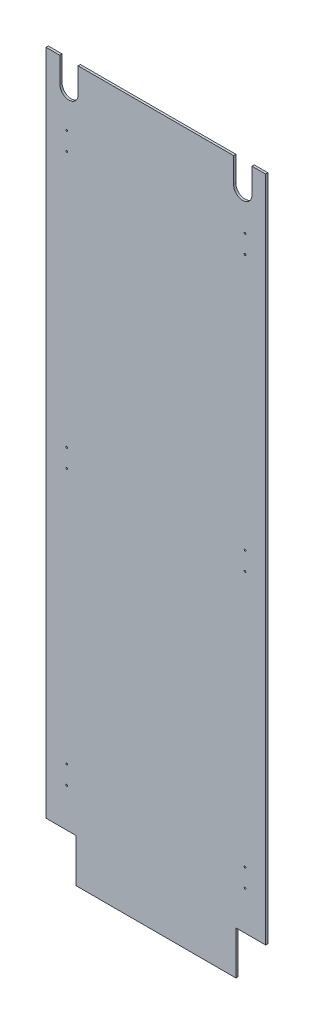
ISO-10303-21;
HEADER;
FILE_DESCRIPTION(('STEP AP214'),'2;1');
FILE_NAME('part.step','',(''),(''),'','','');
FILE_SCHEMA(('AUTOMOTIVE_DESIGN { 1 0 10303 214 1 1 1 1 }'));
ENDSEC;
DATA;
#1=APPLICATION_CONTEXT('core data for automotive mechanical design processes');
#2=APPLICATION_PROTOCOL_DEFINITION('international standard','automotive_design',2000,#1);
#3=PRODUCT_CONTEXT('',#1,'mechanical');
#4=PRODUCT('Part','Part','',(#3));
#5=PRODUCT_RELATED_PRODUCT_CATEGORY('part','',(#4));
#6=PRODUCT_DEFINITION_FORMATION('','',#4);
#7=PRODUCT_DEFINITION_CONTEXT('part definition',#1,'design');
#8=PRODUCT_DEFINITION('design','',#6,#7);
#9=PRODUCT_DEFINITION_SHAPE('','',#8);
#10=(LENGTH_UNIT() NAMED_UNIT(*) SI_UNIT(.MILLI.,.METRE.));
#11=(NAMED_UNIT(*) PLANE_ANGLE_UNIT() SI_UNIT($,.RADIAN.));
#12=(NAMED_UNIT(*) SI_UNIT($,.STERADIAN.) SOLID_ANGLE_UNIT());
#13=UNCERTAINTY_MEASURE_WITH_UNIT(LENGTH_MEASURE(1.E-05),#10,'distance_accuracy_value','');
#14=(GEOMETRIC_REPRESENTATION_CONTEXT(3) GLOBAL_UNCERTAINTY_ASSIGNED_CONTEXT((#13)) GLOBAL_UNIT_ASSIGNED_CONTEXT((#10,
#11,#12)) REPRESENTATION_CONTEXT('',''));
#15=CARTESIAN_POINT('',(0.,0.,0.));
#16=DIRECTION('',(0.,0.,1.));
#17=DIRECTION('',(1.,0.,0.));
#18=AXIS2_PLACEMENT_3D('',#15,#16,#17);
#19=CARTESIAN_POINT('',(0.,0.,6.35));
#20=DIRECTION('',(0.,0.,1.));
#21=DIRECTION('',(1.,0.,0.));
#22=AXIS2_PLACEMENT_3D('',#19,#20,#21);
#23=PLANE('',#22);
#24=CARTESIAN_POINT('',(247.65,815.975,6.35));
#25=DIRECTION('',(0.,0.,-1.));
#26=DIRECTION('',(-1.,0.,0.));
#27=AXIS2_PLACEMENT_3D('',#24,#25,#26);
#28=CIRCLE('',#27,2.3876);
#29=CARTESIAN_POINT('',(245.2624,815.975,6.35));
#30=VERTEX_POINT('',#29);
#31=EDGE_CURVE('E261',#30,#30,#28,.T.);
#32=ORIENTED_EDGE('',*,*,#31,.T.);
#33=EDGE_LOOP('',(#32));
#34=FACE_BOUND('',#33,.T.);
#35=CARTESIAN_POINT('',(247.65,765.175,6.35));
#36=DIRECTION('',(0.,0.,-1.));
#37=DIRECTION('',(-1.,0.,0.));
#38=AXIS2_PLACEMENT_3D('',#35,#36,#37);
#39=CIRCLE('',#38,2.3876);
#40=CARTESIAN_POINT('',(245.2624,765.175,6.35));
#41=VERTEX_POINT('',#40);
#42=EDGE_CURVE('E264',#41,#41,#39,.T.);
#43=ORIENTED_EDGE('',*,*,#42,.T.);
#44=EDGE_LOOP('',(#43));
#45=FACE_BOUND('',#44,.T.);
#46=CARTESIAN_POINT('',(-247.65,815.975,6.35));
#47=DIRECTION('',(0.,0.,-1.));
#48=DIRECTION('',(-1.,0.,0.));
#49=AXIS2_PLACEMENT_3D('',#46,#47,#48);
#50=CIRCLE('',#49,2.3876);
#51=CARTESIAN_POINT('',(-250.0376,815.975,6.35));
#52=VERTEX_POINT('',#51);
#53=EDGE_CURVE('E267',#52,#52,#50,.T.);
#54=ORIENTED_EDGE('',*,*,#53,.T.);
#55=EDGE_LOOP('',(#54));
#56=FACE_BOUND('',#55,.T.);
#57=CARTESIAN_POINT('',(-247.65,765.175,6.35));
#58=DIRECTION('',(0.,0.,-1.));
#59=DIRECTION('',(-1.,0.,0.));
#60=AXIS2_PLACEMENT_3D('',#57,#58,#59);
#61=CIRCLE('',#60,2.3876);
#62=CARTESIAN_POINT('',(-250.0376,765.175,6.35));
#63=VERTEX_POINT('',#62);
#64=EDGE_CURVE('E270',#63,#63,#61,.T.);
#65=ORIENTED_EDGE('',*,*,#64,.T.);
#66=EDGE_LOOP('',(#65));
#67=FACE_BOUND('',#66,.T.);
#68=CARTESIAN_POINT('',(247.65,53.975,6.35));
#69=DIRECTION('',(0.,0.,-1.));
#70=DIRECTION('',(-1.,0.,0.));
#71=AXIS2_PLACEMENT_3D('',#68,#69,#70);
#72=CIRCLE('',#71,2.3876);
#73=CARTESIAN_POINT('',(245.2624,53.975,6.35));
#74=VERTEX_POINT('',#73);
#75=EDGE_CURVE('E273',#74,#74,#72,.T.);
#76=ORIENTED_EDGE('',*,*,#75,.T.);
#77=EDGE_LOOP('',(#76));
#78=FACE_BOUND('',#77,.T.);
#79=CARTESIAN_POINT('',(247.65,3.175,6.35));
#80=DIRECTION('',(0.,0.,-1.));
#81=DIRECTION('',(-1.,0.,0.));
#82=AXIS2_PLACEMENT_3D('',#79,#80,#81);
#83=CIRCLE('',#82,2.3876);
#84=CARTESIAN_POINT('',(245.2624,3.175,6.35));
#85=VERTEX_POINT('',#84);
#86=EDGE_CURVE('E276',#85,#85,#83,.T.);
#87=ORIENTED_EDGE('',*,*,#86,.T.);
#88=EDGE_LOOP('',(#87));
#89=FACE_BOUND('',#88,.T.);
#90=CARTESIAN_POINT('',(-247.65,53.975,6.35));
#91=DIRECTION('',(0.,0.,-1.));
#92=DIRECTION('',(-1.,0.,0.));
#93=AXIS2_PLACEMENT_3D('',#90,#91,#92);
#94=CIRCLE('',#93,2.3876);
#95=CARTESIAN_POINT('',(-250.0376,53.975,6.35));
#96=VERTEX_POINT('',#95);
#97=EDGE_CURVE('E279',#96,#96,#94,.T.);
#98=ORIENTED_EDGE('',*,*,#97,.T.);
#99=EDGE_LOOP('',(#98));
#100=FACE_BOUND('',#99,.T.);
#101=CARTESIAN_POINT('',(-247.65,3.175,6.35));
#102=DIRECTION('',(0.,0.,-1.));
#103=DIRECTION('',(-1.,0.,0.));
#104=AXIS2_PLACEMENT_3D('',#101,#102,#103);
#105=CIRCLE('',#104,2.3876);
#106=CARTESIAN_POINT('',(-250.0376,3.175,6.35));
#107=VERTEX_POINT('',#106);
#108=EDGE_CURVE('E282',#107,#107,#105,.T.);
#109=ORIENTED_EDGE('',*,*,#108,.T.);
#110=EDGE_LOOP('',(#109));
#111=FACE_BOUND('',#110,.T.);
#112=CARTESIAN_POINT('',(247.65,-708.025,6.35));
#113=DIRECTION('',(0.,0.,-1.));
#114=DIRECTION('',(-1.,0.,0.));
#115=AXIS2_PLACEMENT_3D('',#112,#113,#114);
#116=CIRCLE('',#115,2.3876);
#117=CARTESIAN_POINT('',(245.2624,-708.025,6.35));
#118=VERTEX_POINT('',#117);
#119=EDGE_CURVE('E285',#118,#118,#116,.T.);
#120=ORIENTED_EDGE('',*,*,#119,.T.);
#121=EDGE_LOOP('',(#120));
#122=FACE_BOUND('',#121,.T.);
#123=CARTESIAN_POINT('',(247.65,-758.825,6.35));
#124=DIRECTION('',(0.,0.,-1.));
#125=DIRECTION('',(-1.,0.,0.));
#126=AXIS2_PLACEMENT_3D('',#123,#124,#125);
#127=CIRCLE('',#126,2.3876);
#128=CARTESIAN_POINT('',(245.2624,-758.825,6.35));
#129=VERTEX_POINT('',#128);
#130=EDGE_CURVE('E288',#129,#129,#127,.T.);
#131=ORIENTED_EDGE('',*,*,#130,.T.);
#132=EDGE_LOOP('',(#131));
#133=FACE_BOUND('',#132,.T.);
#134=CARTESIAN_POINT('',(-247.65,-708.025,6.35));
#135=DIRECTION('',(0.,0.,-1.));
#136=DIRECTION('',(-1.,0.,0.));
#137=AXIS2_PLACEMENT_3D('',#134,#135,#136);
#138=CIRCLE('',#137,2.3876);
#139=CARTESIAN_POINT('',(-250.0376,-708.025,6.35));
#140=VERTEX_POINT('',#139);
#141=EDGE_CURVE('E291',#140,#140,#138,.T.);
#142=ORIENTED_EDGE('',*,*,#141,.T.);
#143=EDGE_LOOP('',(#142));
#144=FACE_BOUND('',#143,.T.);
#145=CARTESIAN_POINT('',(-247.65,-758.825,6.35));
#146=DIRECTION('',(0.,0.,-1.));
#147=DIRECTION('',(-1.,0.,0.));
#148=AXIS2_PLACEMENT_3D('',#145,#146,#147);
#149=CIRCLE('',#148,2.3876);
#150=CARTESIAN_POINT('',(-250.0376,-758.825,6.35));
#151=VERTEX_POINT('',#150);
#152=EDGE_CURVE('E294',#151,#151,#149,.T.);
#153=ORIENTED_EDGE('',*,*,#152,.T.);
#154=EDGE_LOOP('',(#153));
#155=FACE_BOUND('',#154,.T.);
#156=CARTESIAN_POINT('',(-241.3,917.575,6.35));
#157=DIRECTION('',(0.,0.,1.));
#158=DIRECTION('',(1.,0.,0.));
#159=AXIS2_PLACEMENT_3D('',#156,#157,#158);
#160=CIRCLE('',#159,25.4);
#161=CARTESIAN_POINT('',(-215.9,917.575,6.35));
#162=VERTEX_POINT('',#161);
#163=CARTESIAN_POINT('',(-266.7,917.575,6.35));
#164=VERTEX_POINT('',#163);
#165=EDGE_CURVE('E141',#162,#164,#160,.F.);
#166=ORIENTED_EDGE('',*,*,#165,.T.);
#167=DIRECTION('',(0.,1.,0.));
#168=VECTOR('',#167,1.);
#169=CARTESIAN_POINT('',(-266.7,987.425,6.35));
#170=LINE('',#169,#168);
#171=CARTESIAN_POINT('',(-266.7,987.425,6.35));
#172=VERTEX_POINT('',#171);
#173=EDGE_CURVE('E138',#164,#172,#170,.T.);
#174=ORIENTED_EDGE('',*,*,#173,.T.);
#175=DIRECTION('',(1.,0.,0.));
#176=VECTOR('',#175,1.);
#177=CARTESIAN_POINT('',(304.8,987.425,6.35));
#178=LINE('',#177,#176);
#179=CARTESIAN_POINT('',(-304.8,987.425,6.35));
#180=VERTEX_POINT('',#179);
#181=EDGE_CURVE('E130',#180,#172,#178,.T.);
#182=ORIENTED_EDGE('',*,*,#181,.F.);
#183=DIRECTION('',(0.,1.,0.));
#184=VECTOR('',#183,1.);
#185=CARTESIAN_POINT('',(-304.8,987.425,6.35));
#186=LINE('',#185,#184);
#187=CARTESIAN_POINT('',(-304.8,-866.775,6.35));
#188=VERTEX_POINT('',#187);
#189=EDGE_CURVE('E125',#188,#180,#186,.T.);
#190=ORIENTED_EDGE('',*,*,#189,.F.);
#191=DIRECTION('',(1.,0.,0.));
#192=VECTOR('',#191,1.);
#193=CARTESIAN_POINT('',(-222.25,-866.775,6.35));
#194=LINE('',#193,#192);
#195=CARTESIAN_POINT('',(-222.25,-866.775,6.35));
#196=VERTEX_POINT('',#195);
#197=EDGE_CURVE('E212',#188,#196,#194,.T.);
#198=ORIENTED_EDGE('',*,*,#197,.T.);
#199=DIRECTION('',(0.,1.,0.));
#200=VECTOR('',#199,1.);
#201=CARTESIAN_POINT('',(-222.25,-987.425,6.35));
#202=LINE('',#201,#200);
#203=CARTESIAN_POINT('',(-222.25,-987.425,6.35));
#204=VERTEX_POINT('',#203);
#205=EDGE_CURVE('E204',#196,#204,#202,.F.);
#206=ORIENTED_EDGE('',*,*,#205,.T.);
#207=DIRECTION('',(1.,0.,0.));
#208=VECTOR('',#207,1.);
#209=CARTESIAN_POINT('',(-304.8,-987.425,6.35));
#210=LINE('',#209,#208);
#211=CARTESIAN_POINT('',(222.25,-987.425,6.35));
#212=VERTEX_POINT('',#211);
#213=EDGE_CURVE('E201',#212,#204,#210,.F.);
#214=ORIENTED_EDGE('',*,*,#213,.F.);
#215=DIRECTION('',(0.,1.,0.));
#216=VECTOR('',#215,1.);
#217=CARTESIAN_POINT('',(222.25,-866.775,6.35));
#218=LINE('',#217,#216);
#219=CARTESIAN_POINT('',(222.25,-866.775,6.35));
#220=VERTEX_POINT('',#219);
#221=EDGE_CURVE('E196',#212,#220,#218,.T.);
#222=ORIENTED_EDGE('',*,*,#221,.T.);
#223=DIRECTION('',(1.,0.,0.));
#224=VECTOR('',#223,1.);
#225=CARTESIAN_POINT('',(304.8,-866.775,6.35));
#226=LINE('',#225,#224);
#227=CARTESIAN_POINT('',(304.8,-866.775,6.35));
#228=VERTEX_POINT('',#227);
#229=EDGE_CURVE('E188',#220,#228,#226,.T.);
#230=ORIENTED_EDGE('',*,*,#229,.T.);
#231=DIRECTION('',(0.,1.,0.));
#232=VECTOR('',#231,1.);
#233=CARTESIAN_POINT('',(304.8,-987.425,6.35));
#234=LINE('',#233,#232);
#235=CARTESIAN_POINT('',(304.8,987.425,6.35));
#236=VERTEX_POINT('',#235);
#237=EDGE_CURVE('E186',#236,#228,#234,.F.);
#238=ORIENTED_EDGE('',*,*,#237,.F.);
#239=DIRECTION('',(1.,0.,0.));
#240=VECTOR('',#239,1.);
#241=CARTESIAN_POINT('',(304.8,987.425,6.35));
#242=LINE('',#241,#240);
#243=CARTESIAN_POINT('',(266.7,987.425,6.35));
#244=VERTEX_POINT('',#243);
#245=EDGE_CURVE('E75',#244,#236,#242,.T.);
#246=ORIENTED_EDGE('',*,*,#245,.F.);
#247=DIRECTION('',(0.,1.,0.));
#248=VECTOR('',#247,1.);
#249=CARTESIAN_POINT('',(266.7,917.575,6.35));
#250=LINE('',#249,#248);
#251=CARTESIAN_POINT('',(266.7,917.575,6.35));
#252=VERTEX_POINT('',#251);
#253=EDGE_CURVE('E68',#244,#252,#250,.F.);
#254=ORIENTED_EDGE('',*,*,#253,.T.);
#255=CARTESIAN_POINT('',(241.3,917.575,6.35));
#256=DIRECTION('',(0.,0.,1.));
#257=DIRECTION('',(1.,0.,0.));
#258=AXIS2_PLACEMENT_3D('',#255,#256,#257);
#259=CIRCLE('',#258,25.4);
#260=CARTESIAN_POINT('',(215.9,917.575,6.35));
#261=VERTEX_POINT('',#260);
#262=EDGE_CURVE('E20',#252,#261,#259,.F.);
#263=ORIENTED_EDGE('',*,*,#262,.T.);
#264=DIRECTION('',(0.,1.,0.));
#265=VECTOR('',#264,1.);
#266=CARTESIAN_POINT('',(215.9,987.425,6.35));
#267=LINE('',#266,#265);
#268=CARTESIAN_POINT('',(215.9,987.425,6.35));
#269=VERTEX_POINT('',#268);
#270=EDGE_CURVE('E168',#261,#269,#267,.T.);
#271=ORIENTED_EDGE('',*,*,#270,.T.);
#272=DIRECTION('',(1.,0.,0.));
#273=VECTOR('',#272,1.);
#274=CARTESIAN_POINT('',(304.8,987.425,6.35));
#275=LINE('',#274,#273);
#276=CARTESIAN_POINT('',(-215.9,987.425,6.35));
#277=VERTEX_POINT('',#276);
#278=EDGE_CURVE('E164',#277,#269,#275,.T.);
#279=ORIENTED_EDGE('',*,*,#278,.F.);
#280=DIRECTION('',(0.,1.,0.));
#281=VECTOR('',#280,1.);
#282=CARTESIAN_POINT('',(-215.9,917.575,6.35));
#283=LINE('',#282,#281);
#284=EDGE_CURVE('E159',#277,#162,#283,.F.);
#285=ORIENTED_EDGE('',*,*,#284,.T.);
#286=EDGE_LOOP('',(#166,#174,#182,#190,#198,#206,#214,#222,#230,#238,#246,#254,#263,#271,#279,#285));
#287=FACE_BOUND('',#286,.T.);
#288=ADVANCED_FACE('F17',(#34,#45,#56,#67,#78,#89,#100,#111,#122,#133,#144,#155,#287),#23,.T.);
#289=CARTESIAN_POINT('',(-266.7,987.425,6.35));
#290=DIRECTION('',(-1.,0.,0.));
#291=DIRECTION('',(0.,0.,1.));
#292=AXIS2_PLACEMENT_3D('',#289,#290,#291);
#293=PLANE('',#292);
#294=ORIENTED_EDGE('',*,*,#173,.F.);
#295=DIRECTION('',(0.,0.,1.));
#296=VECTOR('',#295,1.);
#297=CARTESIAN_POINT('',(-266.7,917.575,6.35));
#298=LINE('',#297,#296);
#299=CARTESIAN_POINT('',(-266.7,917.575,0.));
#300=VERTEX_POINT('',#299);
#301=EDGE_CURVE('E296',#164,#300,#298,.F.);
#302=ORIENTED_EDGE('',*,*,#301,.T.);
#303=DIRECTION('',(0.,1.,0.));
#304=VECTOR('',#303,1.);
#305=CARTESIAN_POINT('',(-266.7,0.,0.));
#306=LINE('',#305,#304);
#307=CARTESIAN_POINT('',(-266.7,987.425,0.));
#308=VERTEX_POINT('',#307);
#309=EDGE_CURVE('E148',#300,#308,#306,.T.);
#310=ORIENTED_EDGE('',*,*,#309,.T.);
#311=DIRECTION('',(0.,0.,1.));
#312=VECTOR('',#311,1.);
#313=CARTESIAN_POINT('',(-266.7,987.425,0.));
#314=LINE('',#313,#312);
#315=EDGE_CURVE('E135',#172,#308,#314,.F.);
#316=ORIENTED_EDGE('',*,*,#315,.F.);
#317=EDGE_LOOP('',(#294,#302,#310,#316));
#318=FACE_BOUND('',#317,.T.);
#319=ADVANCED_FACE('F147',(#318),#293,.F.);
#320=CARTESIAN_POINT('',(304.8,987.425,0.));
#321=DIRECTION('',(0.,1.,0.));
#322=DIRECTION('',(0.,0.,1.));
#323=AXIS2_PLACEMENT_3D('',#320,#321,#322);
#324=PLANE('',#323);
#325=ORIENTED_EDGE('',*,*,#181,.T.);
#326=ORIENTED_EDGE('',*,*,#315,.T.);
#327=DIRECTION('',(1.,0.,0.));
#328=VECTOR('',#327,1.);
#329=CARTESIAN_POINT('',(0.,987.425,0.));
#330=LINE('',#329,#328);
#331=CARTESIAN_POINT('',(-304.8,987.425,0.));
#332=VERTEX_POINT('',#331);
#333=EDGE_CURVE('E388',#308,#332,#330,.F.);
#334=ORIENTED_EDGE('',*,*,#333,.T.);
#335=DIRECTION('',(0.,0.,1.));
#336=VECTOR('',#335,1.);
#337=CARTESIAN_POINT('',(-304.8,987.425,0.));
#338=LINE('',#337,#336);
#339=EDGE_CURVE('E137',#180,#332,#338,.F.);
#340=ORIENTED_EDGE('',*,*,#339,.F.);
#341=EDGE_LOOP('',(#325,#326,#334,#340));
#342=FACE_BOUND('',#341,.T.);
#343=ADVANCED_FACE('F132',(#342),#324,.T.);
#344=CARTESIAN_POINT('',(-304.8,987.425,0.));
#345=DIRECTION('',(-1.,0.,0.));
#346=DIRECTION('',(0.,0.,1.));
#347=AXIS2_PLACEMENT_3D('',#344,#345,#346);
#348=PLANE('',#347);
#349=DIRECTION('',(0.,1.,0.));
#350=VECTOR('',#349,1.);
#351=CARTESIAN_POINT('',(-304.8,0.,0.));
#352=LINE('',#351,#350);
#353=CARTESIAN_POINT('',(-304.8,-866.775,0.));
#354=VERTEX_POINT('',#353);
#355=EDGE_CURVE('E380',#332,#354,#352,.F.);
#356=ORIENTED_EDGE('',*,*,#355,.T.);
#357=DIRECTION('',(0.,0.,1.));
#358=VECTOR('',#357,1.);
#359=CARTESIAN_POINT('',(-304.8,-866.775,6.35));
#360=LINE('',#359,#358);
#361=EDGE_CURVE('E214',#354,#188,#360,.T.);
#362=ORIENTED_EDGE('',*,*,#361,.T.);
#363=ORIENTED_EDGE('',*,*,#189,.T.);
#364=ORIENTED_EDGE('',*,*,#339,.T.);
#365=EDGE_LOOP('',(#356,#362,#363,#364));
#366=FACE_BOUND('',#365,.T.);
#367=ADVANCED_FACE('F455',(#366),#348,.T.);
#368=CARTESIAN_POINT('',(-222.25,-866.775,6.35));
#369=DIRECTION('',(0.,1.,0.));
#370=DIRECTION('',(0.,0.,1.));
#371=AXIS2_PLACEMENT_3D('',#368,#369,#370);
#372=PLANE('',#371);
#373=ORIENTED_EDGE('',*,*,#197,.F.);
#374=ORIENTED_EDGE('',*,*,#361,.F.);
#375=DIRECTION('',(1.,0.,0.));
#376=VECTOR('',#375,1.);
#377=CARTESIAN_POINT('',(0.,-866.775,0.));
#378=LINE('',#377,#376);
#379=CARTESIAN_POINT('',(-222.25,-866.775,0.));
#380=VERTEX_POINT('',#379);
#381=EDGE_CURVE('E371',#354,#380,#378,.T.);
#382=ORIENTED_EDGE('',*,*,#381,.T.);
#383=DIRECTION('',(0.,0.,-1.));
#384=VECTOR('',#383,1.);
#385=CARTESIAN_POINT('',(-222.25,-866.775,6.35));
#386=LINE('',#385,#384);
#387=EDGE_CURVE('E209',#380,#196,#386,.F.);
#388=ORIENTED_EDGE('',*,*,#387,.T.);
#389=EDGE_LOOP('',(#373,#374,#382,#388));
#390=FACE_BOUND('',#389,.T.);
#391=ADVANCED_FACE('F453',(#390),#372,.F.);
#392=CARTESIAN_POINT('',(-222.25,-987.425,6.35));
#393=DIRECTION('',(1.,0.,0.));
#394=DIRECTION('',(0.,0.,-1.));
#395=AXIS2_PLACEMENT_3D('',#392,#393,#394);
#396=PLANE('',#395);
#397=ORIENTED_EDGE('',*,*,#205,.F.);
#398=ORIENTED_EDGE('',*,*,#387,.F.);
#399=DIRECTION('',(0.,1.,0.));
#400=VECTOR('',#399,1.);
#401=CARTESIAN_POINT('',(-222.25,0.,0.));
#402=LINE('',#401,#400);
#403=CARTESIAN_POINT('',(-222.25,-987.425,0.));
#404=VERTEX_POINT('',#403);
#405=EDGE_CURVE('E363',#380,#404,#402,.F.);
#406=ORIENTED_EDGE('',*,*,#405,.T.);
#407=DIRECTION('',(0.,0.,-1.));
#408=VECTOR('',#407,1.);
#409=CARTESIAN_POINT('',(-222.25,-987.425,0.));
#410=LINE('',#409,#408);
#411=EDGE_CURVE('E203',#204,#404,#410,.T.);
#412=ORIENTED_EDGE('',*,*,#411,.F.);
#413=EDGE_LOOP('',(#397,#398,#406,#412));
#414=FACE_BOUND('',#413,.T.);
#415=ADVANCED_FACE('F450',(#414),#396,.F.);
#416=CARTESIAN_POINT('',(-304.8,-987.425,0.));
#417=DIRECTION('',(0.,-1.,0.));
#418=DIRECTION('',(0.,0.,-1.));
#419=AXIS2_PLACEMENT_3D('',#416,#417,#418);
#420=PLANE('',#419);
#421=ORIENTED_EDGE('',*,*,#213,.T.);
#422=ORIENTED_EDGE('',*,*,#411,.T.);
#423=DIRECTION('',(1.,0.,0.));
#424=VECTOR('',#423,1.);
#425=CARTESIAN_POINT('',(0.,-987.425,0.));
#426=LINE('',#425,#424);
#427=CARTESIAN_POINT('',(222.25,-987.425,0.));
#428=VERTEX_POINT('',#427);
#429=EDGE_CURVE('E354',#404,#428,#426,.T.);
#430=ORIENTED_EDGE('',*,*,#429,.T.);
#431=DIRECTION('',(0.,0.,1.));
#432=VECTOR('',#431,1.);
#433=CARTESIAN_POINT('',(222.25,-987.425,6.35));
#434=LINE('',#433,#432);
#435=EDGE_CURVE('E198',#428,#212,#434,.T.);
#436=ORIENTED_EDGE('',*,*,#435,.T.);
#437=EDGE_LOOP('',(#421,#422,#430,#436));
#438=FACE_BOUND('',#437,.T.);
#439=ADVANCED_FACE('F444',(#438),#420,.T.);
#440=CARTESIAN_POINT('',(222.25,-866.775,6.35));
#441=DIRECTION('',(-1.,0.,0.));
#442=DIRECTION('',(0.,0.,1.));
#443=AXIS2_PLACEMENT_3D('',#440,#441,#442);
#444=PLANE('',#443);
#445=ORIENTED_EDGE('',*,*,#221,.F.);
#446=ORIENTED_EDGE('',*,*,#435,.F.);
#447=DIRECTION('',(0.,1.,0.));
#448=VECTOR('',#447,1.);
#449=CARTESIAN_POINT('',(222.25,0.,0.));
#450=LINE('',#449,#448);
#451=CARTESIAN_POINT('',(222.25,-866.775,0.));
#452=VERTEX_POINT('',#451);
#453=EDGE_CURVE('E345',#428,#452,#450,.T.);
#454=ORIENTED_EDGE('',*,*,#453,.T.);
#455=DIRECTION('',(0.,0.,1.));
#456=VECTOR('',#455,1.);
#457=CARTESIAN_POINT('',(222.25,-866.775,6.35));
#458=LINE('',#457,#456);
#459=EDGE_CURVE('E193',#452,#220,#458,.T.);
#460=ORIENTED_EDGE('',*,*,#459,.T.);
#461=EDGE_LOOP('',(#445,#446,#454,#460));
#462=FACE_BOUND('',#461,.T.);
#463=ADVANCED_FACE('F442',(#462),#444,.F.);
#464=CARTESIAN_POINT('',(304.8,-866.775,6.35));
#465=DIRECTION('',(0.,1.,0.));
#466=DIRECTION('',(0.,0.,1.));
#467=AXIS2_PLACEMENT_3D('',#464,#465,#466);
#468=PLANE('',#467);
#469=ORIENTED_EDGE('',*,*,#229,.F.);
#470=ORIENTED_EDGE('',*,*,#459,.F.);
#471=DIRECTION('',(1.,0.,0.));
#472=VECTOR('',#471,1.);
#473=CARTESIAN_POINT('',(0.,-866.775,0.));
#474=LINE('',#473,#472);
#475=CARTESIAN_POINT('',(304.8,-866.775,0.));
#476=VERTEX_POINT('',#475);
#477=EDGE_CURVE('E337',#452,#476,#474,.T.);
#478=ORIENTED_EDGE('',*,*,#477,.T.);
#479=DIRECTION('',(0.,0.,-1.));
#480=VECTOR('',#479,1.);
#481=CARTESIAN_POINT('',(304.8,-866.775,0.));
#482=LINE('',#481,#480);
#483=EDGE_CURVE('E183',#228,#476,#482,.T.);
#484=ORIENTED_EDGE('',*,*,#483,.F.);
#485=EDGE_LOOP('',(#469,#470,#478,#484));
#486=FACE_BOUND('',#485,.T.);
#487=ADVANCED_FACE('F437',(#486),#468,.F.);
#488=CARTESIAN_POINT('',(304.8,-987.425,0.));
#489=DIRECTION('',(1.,0.,0.));
#490=DIRECTION('',(0.,0.,-1.));
#491=AXIS2_PLACEMENT_3D('',#488,#489,#490);
#492=PLANE('',#491);
#493=ORIENTED_EDGE('',*,*,#237,.T.);
#494=ORIENTED_EDGE('',*,*,#483,.T.);
#495=DIRECTION('',(0.,1.,0.));
#496=VECTOR('',#495,1.);
#497=CARTESIAN_POINT('',(304.8,0.,0.));
#498=LINE('',#497,#496);
#499=CARTESIAN_POINT('',(304.8,987.425,0.));
#500=VERTEX_POINT('',#499);
#501=EDGE_CURVE('E328',#476,#500,#498,.T.);
#502=ORIENTED_EDGE('',*,*,#501,.T.);
#503=DIRECTION('',(0.,0.,1.));
#504=VECTOR('',#503,1.);
#505=CARTESIAN_POINT('',(304.8,987.425,0.));
#506=LINE('',#505,#504);
#507=EDGE_CURVE('E182',#236,#500,#506,.F.);
#508=ORIENTED_EDGE('',*,*,#507,.F.);
#509=EDGE_LOOP('',(#493,#494,#502,#508));
#510=FACE_BOUND('',#509,.T.);
#511=ADVANCED_FACE('F433',(#510),#492,.T.);
#512=CARTESIAN_POINT('',(304.8,987.425,0.));
#513=DIRECTION('',(0.,1.,0.));
#514=DIRECTION('',(0.,0.,1.));
#515=AXIS2_PLACEMENT_3D('',#512,#513,#514);
#516=PLANE('',#515);
#517=DIRECTION('',(1.,0.,0.));
#518=VECTOR('',#517,1.);
#519=CARTESIAN_POINT('',(0.,987.425,0.));
#520=LINE('',#519,#518);
#521=CARTESIAN_POINT('',(266.7,987.425,0.));
#522=VERTEX_POINT('',#521);
#523=EDGE_CURVE('E325',#500,#522,#520,.F.);
#524=ORIENTED_EDGE('',*,*,#523,.T.);
#525=DIRECTION('',(0.,0.,-1.));
#526=VECTOR('',#525,1.);
#527=CARTESIAN_POINT('',(266.7,987.425,6.35));
#528=LINE('',#527,#526);
#529=EDGE_CURVE('E178',#522,#244,#528,.F.);
#530=ORIENTED_EDGE('',*,*,#529,.T.);
#531=ORIENTED_EDGE('',*,*,#245,.T.);
#532=ORIENTED_EDGE('',*,*,#507,.T.);
#533=EDGE_LOOP('',(#524,#530,#531,#532));
#534=FACE_BOUND('',#533,.T.);
#535=ADVANCED_FACE('F428',(#534),#516,.T.);
#536=CARTESIAN_POINT('',(266.7,917.575,6.35));
#537=DIRECTION('',(1.,0.,0.));
#538=DIRECTION('',(0.,0.,-1.));
#539=AXIS2_PLACEMENT_3D('',#536,#537,#538);
#540=PLANE('',#539);
#541=ORIENTED_EDGE('',*,*,#253,.F.);
#542=ORIENTED_EDGE('',*,*,#529,.F.);
#543=DIRECTION('',(0.,1.,0.));
#544=VECTOR('',#543,1.);
#545=CARTESIAN_POINT('',(266.7,0.,0.));
#546=LINE('',#545,#544);
#547=CARTESIAN_POINT('',(266.7,917.575,0.));
#548=VERTEX_POINT('',#547);
#549=EDGE_CURVE('E260',#522,#548,#546,.F.);
#550=ORIENTED_EDGE('',*,*,#549,.T.);
#551=DIRECTION('',(0.,0.,1.));
#552=VECTOR('',#551,1.);
#553=CARTESIAN_POINT('',(266.7,917.575,6.35));
#554=LINE('',#553,#552);
#555=EDGE_CURVE('E177',#548,#252,#554,.T.);
#556=ORIENTED_EDGE('',*,*,#555,.T.);
#557=EDGE_LOOP('',(#541,#542,#550,#556));
#558=FACE_BOUND('',#557,.T.);
#559=ADVANCED_FACE('F533',(#558),#540,.F.);
#560=CARTESIAN_POINT('',(241.3,917.575,6.35));
#561=DIRECTION('',(0.,0.,1.));
#562=DIRECTION('',(1.,0.,0.));
#563=AXIS2_PLACEMENT_3D('',#560,#561,#562);
#564=CYLINDRICAL_SURFACE('',#563,25.4);
#565=ORIENTED_EDGE('',*,*,#262,.F.);
#566=ORIENTED_EDGE('',*,*,#555,.F.);
#567=CARTESIAN_POINT('',(241.3,917.575,0.));
#568=DIRECTION('',(0.,0.,1.));
#569=DIRECTION('',(1.,0.,0.));
#570=AXIS2_PLACEMENT_3D('',#567,#568,#569);
#571=CIRCLE('',#570,25.4);
#572=CARTESIAN_POINT('',(215.9,917.575,0.));
#573=VERTEX_POINT('',#572);
#574=EDGE_CURVE('E256',#548,#573,#571,.F.);
#575=ORIENTED_EDGE('',*,*,#574,.T.);
#576=DIRECTION('',(0.,0.,1.));
#577=VECTOR('',#576,1.);
#578=CARTESIAN_POINT('',(215.9,917.575,6.35));
#579=LINE('',#578,#577);
#580=EDGE_CURVE('E173',#573,#261,#579,.T.);
#581=ORIENTED_EDGE('',*,*,#580,.T.);
#582=EDGE_LOOP('',(#565,#566,#575,#581));
#583=FACE_BOUND('',#582,.T.);
#584=ADVANCED_FACE('F530',(#583),#564,.F.);
#585=CARTESIAN_POINT('',(215.9,987.425,6.35));
#586=DIRECTION('',(-1.,0.,0.));
#587=DIRECTION('',(0.,0.,1.));
#588=AXIS2_PLACEMENT_3D('',#585,#586,#587);
#589=PLANE('',#588);
#590=ORIENTED_EDGE('',*,*,#270,.F.);
#591=ORIENTED_EDGE('',*,*,#580,.F.);
#592=DIRECTION('',(0.,1.,0.));
#593=VECTOR('',#592,1.);
#594=CARTESIAN_POINT('',(215.9,0.,0.));
#595=LINE('',#594,#593);
#596=CARTESIAN_POINT('',(215.9,987.425,0.));
#597=VERTEX_POINT('',#596);
#598=EDGE_CURVE('E259',#573,#597,#595,.T.);
#599=ORIENTED_EDGE('',*,*,#598,.T.);
#600=DIRECTION('',(0.,0.,1.));
#601=VECTOR('',#600,1.);
#602=CARTESIAN_POINT('',(215.9,987.425,0.));
#603=LINE('',#602,#601);
#604=EDGE_CURVE('E167',#269,#597,#603,.F.);
#605=ORIENTED_EDGE('',*,*,#604,.F.);
#606=EDGE_LOOP('',(#590,#591,#599,#605));
#607=FACE_BOUND('',#606,.T.);
#608=ADVANCED_FACE('F419',(#607),#589,.F.);
#609=CARTESIAN_POINT('',(304.8,987.425,0.));
#610=DIRECTION('',(0.,1.,0.));
#611=DIRECTION('',(0.,0.,1.));
#612=AXIS2_PLACEMENT_3D('',#609,#610,#611);
#613=PLANE('',#612);
#614=DIRECTION('',(1.,0.,0.));
#615=VECTOR('',#614,1.);
#616=CARTESIAN_POINT('',(0.,987.425,0.));
#617=LINE('',#616,#615);
#618=CARTESIAN_POINT('',(-215.9,987.425,0.));
#619=VERTEX_POINT('',#618);
#620=EDGE_CURVE('E308',#597,#619,#617,.F.);
#621=ORIENTED_EDGE('',*,*,#620,.T.);
#622=DIRECTION('',(0.,0.,-1.));
#623=VECTOR('',#622,1.);
#624=CARTESIAN_POINT('',(-215.9,987.425,6.35));
#625=LINE('',#624,#623);
#626=EDGE_CURVE('E161',#619,#277,#625,.F.);
#627=ORIENTED_EDGE('',*,*,#626,.T.);
#628=ORIENTED_EDGE('',*,*,#278,.T.);
#629=ORIENTED_EDGE('',*,*,#604,.T.);
#630=EDGE_LOOP('',(#621,#627,#628,#629));
#631=FACE_BOUND('',#630,.T.);
#632=ADVANCED_FACE('F413',(#631),#613,.T.);
#633=CARTESIAN_POINT('',(-215.9,917.575,6.35));
#634=DIRECTION('',(1.,0.,0.));
#635=DIRECTION('',(0.,0.,-1.));
#636=AXIS2_PLACEMENT_3D('',#633,#634,#635);
#637=PLANE('',#636);
#638=ORIENTED_EDGE('',*,*,#284,.F.);
#639=ORIENTED_EDGE('',*,*,#626,.F.);
#640=DIRECTION('',(0.,1.,0.));
#641=VECTOR('',#640,1.);
#642=CARTESIAN_POINT('',(-215.9,0.,0.));
#643=LINE('',#642,#641);
#644=CARTESIAN_POINT('',(-215.9,917.575,0.));
#645=VERTEX_POINT('',#644);
#646=EDGE_CURVE('E255',#619,#645,#643,.F.);
#647=ORIENTED_EDGE('',*,*,#646,.T.);
#648=DIRECTION('',(0.,0.,1.));
#649=VECTOR('',#648,1.);
#650=CARTESIAN_POINT('',(-215.9,917.575,6.35));
#651=LINE('',#650,#649);
#652=EDGE_CURVE('E35',#645,#162,#651,.T.);
#653=ORIENTED_EDGE('',*,*,#652,.T.);
#654=EDGE_LOOP('',(#638,#639,#647,#653));
#655=FACE_BOUND('',#654,.T.);
#656=ADVANCED_FACE('F407',(#655),#637,.F.);
#657=CARTESIAN_POINT('',(-241.3,917.575,6.35));
#658=DIRECTION('',(0.,0.,1.));
#659=DIRECTION('',(1.,0.,0.));
#660=AXIS2_PLACEMENT_3D('',#657,#658,#659);
#661=CYLINDRICAL_SURFACE('',#660,25.4);
#662=ORIENTED_EDGE('',*,*,#165,.F.);
#663=ORIENTED_EDGE('',*,*,#652,.F.);
#664=CARTESIAN_POINT('',(-241.3,917.575,0.));
#665=DIRECTION('',(0.,0.,1.));
#666=DIRECTION('',(1.,0.,0.));
#667=AXIS2_PLACEMENT_3D('',#664,#665,#666);
#668=CIRCLE('',#667,25.4);
#669=EDGE_CURVE('E253',#645,#300,#668,.F.);
#670=ORIENTED_EDGE('',*,*,#669,.T.);
#671=ORIENTED_EDGE('',*,*,#301,.F.);
#672=EDGE_LOOP('',(#662,#663,#670,#671));
#673=FACE_BOUND('',#672,.T.);
#674=ADVANCED_FACE('F520',(#673),#661,.F.);
#675=CARTESIAN_POINT('',(-247.65,-758.825,0.));
#676=DIRECTION('',(0.,0.,-1.));
#677=DIRECTION('',(-1.,0.,0.));
#678=AXIS2_PLACEMENT_3D('',#675,#676,#677);
#679=CYLINDRICAL_SURFACE('',#678,2.3876);
#680=ORIENTED_EDGE('',*,*,#152,.F.);
#681=EDGE_LOOP('',(#680));
#682=FACE_BOUND('',#681,.T.);
#683=CARTESIAN_POINT('',(-247.65,-758.825,0.));
#684=DIRECTION('',(0.,0.,-1.));
#685=DIRECTION('',(-1.,0.,0.));
#686=AXIS2_PLACEMENT_3D('',#683,#684,#685);
#687=CIRCLE('',#686,2.3876);
#688=CARTESIAN_POINT('',(-250.0376,-758.825,0.));
#689=VERTEX_POINT('',#688);
#690=EDGE_CURVE('E250',#689,#689,#687,.T.);
#691=ORIENTED_EDGE('',*,*,#690,.T.);
#692=EDGE_LOOP('',(#691));
#693=FACE_BOUND('',#692,.T.);
#694=ADVANCED_FACE('F516',(#682,#693),#679,.F.);
#695=CARTESIAN_POINT('',(-247.65,-708.025,0.));
#696=DIRECTION('',(0.,0.,-1.));
#697=DIRECTION('',(-1.,0.,0.));
#698=AXIS2_PLACEMENT_3D('',#695,#696,#697);
#699=CYLINDRICAL_SURFACE('',#698,2.3876);
#700=ORIENTED_EDGE('',*,*,#141,.F.);
#701=EDGE_LOOP('',(#700));
#702=FACE_BOUND('',#701,.T.);
#703=CARTESIAN_POINT('',(-247.65,-708.025,0.));
#704=DIRECTION('',(0.,0.,-1.));
#705=DIRECTION('',(-1.,0.,0.));
#706=AXIS2_PLACEMENT_3D('',#703,#704,#705);
#707=CIRCLE('',#706,2.3876);
#708=CARTESIAN_POINT('',(-250.0376,-708.025,0.));
#709=VERTEX_POINT('',#708);
#710=EDGE_CURVE('E247',#709,#709,#707,.T.);
#711=ORIENTED_EDGE('',*,*,#710,.T.);
#712=EDGE_LOOP('',(#711));
#713=FACE_BOUND('',#712,.T.);
#714=ADVANCED_FACE('F512',(#702,#713),#699,.F.);
#715=CARTESIAN_POINT('',(247.65,-758.825,0.));
#716=DIRECTION('',(0.,0.,-1.));
#717=DIRECTION('',(-1.,0.,0.));
#718=AXIS2_PLACEMENT_3D('',#715,#716,#717);
#719=CYLINDRICAL_SURFACE('',#718,2.3876);
#720=ORIENTED_EDGE('',*,*,#130,.F.);
#721=EDGE_LOOP('',(#720));
#722=FACE_BOUND('',#721,.T.);
#723=CARTESIAN_POINT('',(247.65,-758.825,0.));
#724=DIRECTION('',(0.,0.,-1.));
#725=DIRECTION('',(-1.,0.,0.));
#726=AXIS2_PLACEMENT_3D('',#723,#724,#725);
#727=CIRCLE('',#726,2.3876);
#728=CARTESIAN_POINT('',(245.2624,-758.825,0.));
#729=VERTEX_POINT('',#728);
#730=EDGE_CURVE('E244',#729,#729,#727,.T.);
#731=ORIENTED_EDGE('',*,*,#730,.T.);
#732=EDGE_LOOP('',(#731));
#733=FACE_BOUND('',#732,.T.);
#734=ADVANCED_FACE('F508',(#722,#733),#719,.F.);
#735=CARTESIAN_POINT('',(247.65,-708.025,0.));
#736=DIRECTION('',(0.,0.,-1.));
#737=DIRECTION('',(-1.,0.,0.));
#738=AXIS2_PLACEMENT_3D('',#735,#736,#737);
#739=CYLINDRICAL_SURFACE('',#738,2.3876);
#740=ORIENTED_EDGE('',*,*,#119,.F.);
#741=EDGE_LOOP('',(#740));
#742=FACE_BOUND('',#741,.T.);
#743=CARTESIAN_POINT('',(247.65,-708.025,0.));
#744=DIRECTION('',(0.,0.,-1.));
#745=DIRECTION('',(-1.,0.,0.));
#746=AXIS2_PLACEMENT_3D('',#743,#744,#745);
#747=CIRCLE('',#746,2.3876);
#748=CARTESIAN_POINT('',(245.2624,-708.025,0.));
#749=VERTEX_POINT('',#748);
#750=EDGE_CURVE('E241',#749,#749,#747,.T.);
#751=ORIENTED_EDGE('',*,*,#750,.T.);
#752=EDGE_LOOP('',(#751));
#753=FACE_BOUND('',#752,.T.);
#754=ADVANCED_FACE('F504',(#742,#753),#739,.F.);
#755=CARTESIAN_POINT('',(-247.65,3.175,0.));
#756=DIRECTION('',(0.,0.,-1.));
#757=DIRECTION('',(-1.,0.,0.));
#758=AXIS2_PLACEMENT_3D('',#755,#756,#757);
#759=CYLINDRICAL_SURFACE('',#758,2.3876);
#760=ORIENTED_EDGE('',*,*,#108,.F.);
#761=EDGE_LOOP('',(#760));
#762=FACE_BOUND('',#761,.T.);
#763=CARTESIAN_POINT('',(-247.65,3.175,0.));
#764=DIRECTION('',(0.,0.,-1.));
#765=DIRECTION('',(-1.,0.,0.));
#766=AXIS2_PLACEMENT_3D('',#763,#764,#765);
#767=CIRCLE('',#766,2.3876);
#768=CARTESIAN_POINT('',(-250.0376,3.175,0.));
#769=VERTEX_POINT('',#768);
#770=EDGE_CURVE('E238',#769,#769,#767,.T.);
#771=ORIENTED_EDGE('',*,*,#770,.T.);
#772=EDGE_LOOP('',(#771));
#773=FACE_BOUND('',#772,.T.);
#774=ADVANCED_FACE('F500',(#762,#773),#759,.F.);
#775=CARTESIAN_POINT('',(-247.65,53.975,0.));
#776=DIRECTION('',(0.,0.,-1.));
#777=DIRECTION('',(-1.,0.,0.));
#778=AXIS2_PLACEMENT_3D('',#775,#776,#777);
#779=CYLINDRICAL_SURFACE('',#778,2.3876);
#780=ORIENTED_EDGE('',*,*,#97,.F.);
#781=EDGE_LOOP('',(#780));
#782=FACE_BOUND('',#781,.T.);
#783=CARTESIAN_POINT('',(-247.65,53.975,0.));
#784=DIRECTION('',(0.,0.,-1.));
#785=DIRECTION('',(-1.,0.,0.));
#786=AXIS2_PLACEMENT_3D('',#783,#784,#785);
#787=CIRCLE('',#786,2.3876);
#788=CARTESIAN_POINT('',(-250.0376,53.975,0.));
#789=VERTEX_POINT('',#788);
#790=EDGE_CURVE('E235',#789,#789,#787,.T.);
#791=ORIENTED_EDGE('',*,*,#790,.T.);
#792=EDGE_LOOP('',(#791));
#793=FACE_BOUND('',#792,.T.);
#794=ADVANCED_FACE('F496',(#782,#793),#779,.F.);
#795=CARTESIAN_POINT('',(247.65,3.175,0.));
#796=DIRECTION('',(0.,0.,-1.));
#797=DIRECTION('',(-1.,0.,0.));
#798=AXIS2_PLACEMENT_3D('',#795,#796,#797);
#799=CYLINDRICAL_SURFACE('',#798,2.3876);
#800=ORIENTED_EDGE('',*,*,#86,.F.);
#801=EDGE_LOOP('',(#800));
#802=FACE_BOUND('',#801,.T.);
#803=CARTESIAN_POINT('',(247.65,3.175,0.));
#804=DIRECTION('',(0.,0.,-1.));
#805=DIRECTION('',(-1.,0.,0.));
#806=AXIS2_PLACEMENT_3D('',#803,#804,#805);
#807=CIRCLE('',#806,2.3876);
#808=CARTESIAN_POINT('',(245.2624,3.175,0.));
#809=VERTEX_POINT('',#808);
#810=EDGE_CURVE('E232',#809,#809,#807,.T.);
#811=ORIENTED_EDGE('',*,*,#810,.T.);
#812=EDGE_LOOP('',(#811));
#813=FACE_BOUND('',#812,.T.);
#814=ADVANCED_FACE('F492',(#802,#813),#799,.F.);
#815=CARTESIAN_POINT('',(247.65,53.975,0.));
#816=DIRECTION('',(0.,0.,-1.));
#817=DIRECTION('',(-1.,0.,0.));
#818=AXIS2_PLACEMENT_3D('',#815,#816,#817);
#819=CYLINDRICAL_SURFACE('',#818,2.3876);
#820=ORIENTED_EDGE('',*,*,#75,.F.);
#821=EDGE_LOOP('',(#820));
#822=FACE_BOUND('',#821,.T.);
#823=CARTESIAN_POINT('',(247.65,53.975,0.));
#824=DIRECTION('',(0.,0.,-1.));
#825=DIRECTION('',(-1.,0.,0.));
#826=AXIS2_PLACEMENT_3D('',#823,#824,#825);
#827=CIRCLE('',#826,2.3876);
#828=CARTESIAN_POINT('',(245.2624,53.975,0.));
#829=VERTEX_POINT('',#828);
#830=EDGE_CURVE('E229',#829,#829,#827,.T.);
#831=ORIENTED_EDGE('',*,*,#830,.T.);
#832=EDGE_LOOP('',(#831));
#833=FACE_BOUND('',#832,.T.);
#834=ADVANCED_FACE('F488',(#822,#833),#819,.F.);
#835=CARTESIAN_POINT('',(-247.65,765.175,0.));
#836=DIRECTION('',(0.,0.,-1.));
#837=DIRECTION('',(-1.,0.,0.));
#838=AXIS2_PLACEMENT_3D('',#835,#836,#837);
#839=CYLINDRICAL_SURFACE('',#838,2.3876);
#840=ORIENTED_EDGE('',*,*,#64,.F.);
#841=EDGE_LOOP('',(#840));
#842=FACE_BOUND('',#841,.T.);
#843=CARTESIAN_POINT('',(-247.65,765.175,0.));
#844=DIRECTION('',(0.,0.,-1.));
#845=DIRECTION('',(-1.,0.,0.));
#846=AXIS2_PLACEMENT_3D('',#843,#844,#845);
#847=CIRCLE('',#846,2.3876);
#848=CARTESIAN_POINT('',(-250.0376,765.175,0.));
#849=VERTEX_POINT('',#848);
#850=EDGE_CURVE('E226',#849,#849,#847,.T.);
#851=ORIENTED_EDGE('',*,*,#850,.T.);
#852=EDGE_LOOP('',(#851));
#853=FACE_BOUND('',#852,.T.);
#854=ADVANCED_FACE('F484',(#842,#853),#839,.F.);
#855=CARTESIAN_POINT('',(-247.65,815.975,0.));
#856=DIRECTION('',(0.,0.,-1.));
#857=DIRECTION('',(-1.,0.,0.));
#858=AXIS2_PLACEMENT_3D('',#855,#856,#857);
#859=CYLINDRICAL_SURFACE('',#858,2.3876);
#860=ORIENTED_EDGE('',*,*,#53,.F.);
#861=EDGE_LOOP('',(#860));
#862=FACE_BOUND('',#861,.T.);
#863=CARTESIAN_POINT('',(-247.65,815.975,0.));
#864=DIRECTION('',(0.,0.,-1.));
#865=DIRECTION('',(-1.,0.,0.));
#866=AXIS2_PLACEMENT_3D('',#863,#864,#865);
#867=CIRCLE('',#866,2.3876);
#868=CARTESIAN_POINT('',(-250.0376,815.975,0.));
#869=VERTEX_POINT('',#868);
#870=EDGE_CURVE('E223',#869,#869,#867,.T.);
#871=ORIENTED_EDGE('',*,*,#870,.T.);
#872=EDGE_LOOP('',(#871));
#873=FACE_BOUND('',#872,.T.);
#874=ADVANCED_FACE('F480',(#862,#873),#859,.F.);
#875=CARTESIAN_POINT('',(247.65,765.175,0.));
#876=DIRECTION('',(0.,0.,-1.));
#877=DIRECTION('',(-1.,0.,0.));
#878=AXIS2_PLACEMENT_3D('',#875,#876,#877);
#879=CYLINDRICAL_SURFACE('',#878,2.3876);
#880=ORIENTED_EDGE('',*,*,#42,.F.);
#881=EDGE_LOOP('',(#880));
#882=FACE_BOUND('',#881,.T.);
#883=CARTESIAN_POINT('',(247.65,765.175,0.));
#884=DIRECTION('',(0.,0.,-1.));
#885=DIRECTION('',(-1.,0.,0.));
#886=AXIS2_PLACEMENT_3D('',#883,#884,#885);
#887=CIRCLE('',#886,2.3876);
#888=CARTESIAN_POINT('',(245.2624,765.175,0.));
#889=VERTEX_POINT('',#888);
#890=EDGE_CURVE('E26',#889,#889,#887,.T.);
#891=ORIENTED_EDGE('',*,*,#890,.T.);
#892=EDGE_LOOP('',(#891));
#893=FACE_BOUND('',#892,.T.);
#894=ADVANCED_FACE('F472',(#882,#893),#879,.F.);
#895=CARTESIAN_POINT('',(247.65,815.975,0.));
#896=DIRECTION('',(0.,0.,-1.));
#897=DIRECTION('',(-1.,0.,0.));
#898=AXIS2_PLACEMENT_3D('',#895,#896,#897);
#899=CYLINDRICAL_SURFACE('',#898,2.3876);
#900=ORIENTED_EDGE('',*,*,#31,.F.);
#901=EDGE_LOOP('',(#900));
#902=FACE_BOUND('',#901,.T.);
#903=CARTESIAN_POINT('',(247.65,815.975,0.));
#904=DIRECTION('',(0.,0.,-1.));
#905=DIRECTION('',(-1.,0.,0.));
#906=AXIS2_PLACEMENT_3D('',#903,#904,#905);
#907=CIRCLE('',#906,2.3876);
#908=CARTESIAN_POINT('',(245.2624,815.975,0.));
#909=VERTEX_POINT('',#908);
#910=EDGE_CURVE('E11',#909,#909,#907,.T.);
#911=ORIENTED_EDGE('',*,*,#910,.T.);
#912=EDGE_LOOP('',(#911));
#913=FACE_BOUND('',#912,.T.);
#914=ADVANCED_FACE('F466',(#902,#913),#899,.F.);
#915=CARTESIAN_POINT('',(0.,0.,0.));
#916=DIRECTION('',(0.,0.,1.));
#917=DIRECTION('',(1.,0.,0.));
#918=AXIS2_PLACEMENT_3D('',#915,#916,#917);
#919=PLANE('',#918);
#920=ORIENTED_EDGE('',*,*,#910,.F.);
#921=EDGE_LOOP('',(#920));
#922=FACE_BOUND('',#921,.T.);
#923=ORIENTED_EDGE('',*,*,#890,.F.);
#924=EDGE_LOOP('',(#923));
#925=FACE_BOUND('',#924,.T.);
#926=ORIENTED_EDGE('',*,*,#870,.F.);
#927=EDGE_LOOP('',(#926));
#928=FACE_BOUND('',#927,.T.);
#929=ORIENTED_EDGE('',*,*,#850,.F.);
#930=EDGE_LOOP('',(#929));
#931=FACE_BOUND('',#930,.T.);
#932=ORIENTED_EDGE('',*,*,#830,.F.);
#933=EDGE_LOOP('',(#932));
#934=FACE_BOUND('',#933,.T.);
#935=ORIENTED_EDGE('',*,*,#810,.F.);
#936=EDGE_LOOP('',(#935));
#937=FACE_BOUND('',#936,.T.);
#938=ORIENTED_EDGE('',*,*,#790,.F.);
#939=EDGE_LOOP('',(#938));
#940=FACE_BOUND('',#939,.T.);
#941=ORIENTED_EDGE('',*,*,#770,.F.);
#942=EDGE_LOOP('',(#941));
#943=FACE_BOUND('',#942,.T.);
#944=ORIENTED_EDGE('',*,*,#750,.F.);
#945=EDGE_LOOP('',(#944));
#946=FACE_BOUND('',#945,.T.);
#947=ORIENTED_EDGE('',*,*,#730,.F.);
#948=EDGE_LOOP('',(#947));
#949=FACE_BOUND('',#948,.T.);
#950=ORIENTED_EDGE('',*,*,#710,.F.);
#951=EDGE_LOOP('',(#950));
#952=FACE_BOUND('',#951,.T.);
#953=ORIENTED_EDGE('',*,*,#690,.F.);
#954=EDGE_LOOP('',(#953));
#955=FACE_BOUND('',#954,.T.);
#956=ORIENTED_EDGE('',*,*,#646,.F.);
#957=ORIENTED_EDGE('',*,*,#620,.F.);
#958=ORIENTED_EDGE('',*,*,#598,.F.);
#959=ORIENTED_EDGE('',*,*,#574,.F.);
#960=ORIENTED_EDGE('',*,*,#549,.F.);
#961=ORIENTED_EDGE('',*,*,#523,.F.);
#962=ORIENTED_EDGE('',*,*,#501,.F.);
#963=ORIENTED_EDGE('',*,*,#477,.F.);
#964=ORIENTED_EDGE('',*,*,#453,.F.);
#965=ORIENTED_EDGE('',*,*,#429,.F.);
#966=ORIENTED_EDGE('',*,*,#405,.F.);
#967=ORIENTED_EDGE('',*,*,#381,.F.);
#968=ORIENTED_EDGE('',*,*,#355,.F.);
#969=ORIENTED_EDGE('',*,*,#333,.F.);
#970=ORIENTED_EDGE('',*,*,#309,.F.);
#971=ORIENTED_EDGE('',*,*,#669,.F.);
#972=EDGE_LOOP('',(#956,#957,#958,#959,#960,#961,#962,#963,#964,#965,#966,#967,#968,#969,#970,#971));
#973=FACE_BOUND('',#972,.T.);
#974=ADVANCED_FACE('F410',(#922,#925,#928,#931,#934,#937,#940,#943,#946,#949,#952,#955,#973),
#919,.F.);
#975=CLOSED_SHELL('',(#288,#319,#343,#367,#391,#415,#439,#463,#487,#511,#535,#559,#584,#608,
#632,#656,#674,#694,#714,#734,#754,#774,#794,#814,#834,#854,#874,#894,#914,#974));
#976=MANIFOLD_SOLID_BREP('B1',#975);
#977=ADVANCED_BREP_SHAPE_REPRESENTATION('',(#18,#976),#14);
#978=SHAPE_DEFINITION_REPRESENTATION(#9,#977);
ENDSEC;
END-ISO-10303-21;
